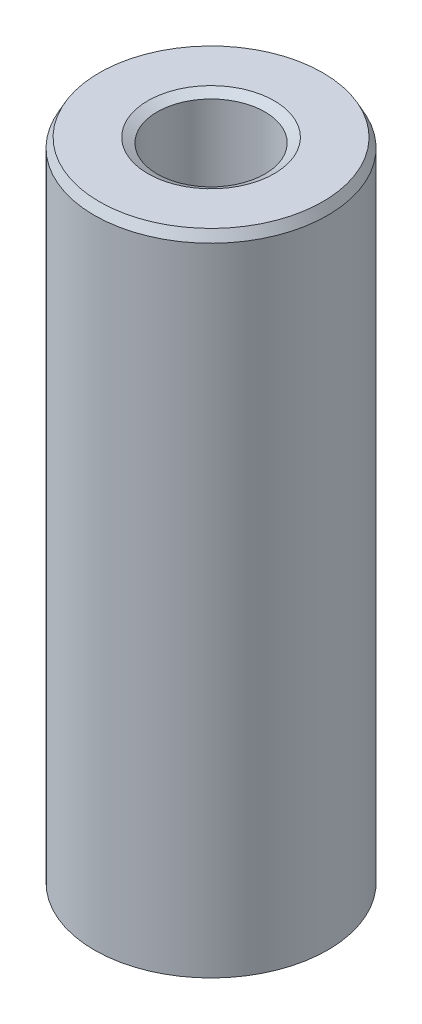
ISO-10303-21;
HEADER;
FILE_DESCRIPTION(('STEP AP214'),'2;1');
FILE_NAME('part.step','',(''),(''),'','','');
FILE_SCHEMA(('AUTOMOTIVE_DESIGN { 1 0 10303 214 1 1 1 1 }'));
ENDSEC;
DATA;
#1=APPLICATION_CONTEXT('core data for automotive mechanical design processes');
#2=APPLICATION_PROTOCOL_DEFINITION('international standard','automotive_design',2000,#1);
#3=PRODUCT_CONTEXT('',#1,'mechanical');
#4=PRODUCT('Part','Part','',(#3));
#5=PRODUCT_RELATED_PRODUCT_CATEGORY('part','',(#4));
#6=PRODUCT_DEFINITION_FORMATION('','',#4);
#7=PRODUCT_DEFINITION_CONTEXT('part definition',#1,'design');
#8=PRODUCT_DEFINITION('design','',#6,#7);
#9=PRODUCT_DEFINITION_SHAPE('','',#8);
#10=(LENGTH_UNIT() NAMED_UNIT(*) SI_UNIT(.MILLI.,.METRE.));
#11=(NAMED_UNIT(*) PLANE_ANGLE_UNIT() SI_UNIT($,.RADIAN.));
#12=(NAMED_UNIT(*) SI_UNIT($,.STERADIAN.) SOLID_ANGLE_UNIT());
#13=UNCERTAINTY_MEASURE_WITH_UNIT(LENGTH_MEASURE(1.E-05),#10,'distance_accuracy_value','');
#14=(GEOMETRIC_REPRESENTATION_CONTEXT(3) GLOBAL_UNCERTAINTY_ASSIGNED_CONTEXT((#13)) GLOBAL_UNIT_ASSIGNED_CONTEXT((#10,
#11,#12)) REPRESENTATION_CONTEXT('',''));
#15=CARTESIAN_POINT('',(0.,0.,0.));
#16=DIRECTION('',(0.,0.,1.));
#17=DIRECTION('',(1.,0.,0.));
#18=AXIS2_PLACEMENT_3D('',#15,#16,#17);
#19=CARTESIAN_POINT('',(0.,139.373056532674,0.));
#20=DIRECTION('',(0.,-1.,0.));
#21=DIRECTION('',(0.,0.,-1.));
#22=AXIS2_PLACEMENT_3D('',#19,#20,#21);
#23=CYLINDRICAL_SURFACE('',#22,25.);
#24=CARTESIAN_POINT('',(0.,1.06443118008448,0.));
#25=DIRECTION('',(0.,1.,0.));
#26=DIRECTION('',(0.,0.,1.));
#27=AXIS2_PLACEMENT_3D('',#24,#25,#26);
#28=CIRCLE('',#27,25.);
#29=CARTESIAN_POINT('',(0.,1.06443118008448,25.));
#30=VERTEX_POINT('',#29);
#31=EDGE_CURVE('E10',#30,#30,#28,.T.);
#32=ORIENTED_EDGE('',*,*,#31,.T.);
#33=EDGE_LOOP('',(#32));
#34=FACE_BOUND('',#33,.T.);
#35=CARTESIAN_POINT('',(0.,137.371228391076,0.));
#36=DIRECTION('',(0.,1.,0.));
#37=DIRECTION('',(0.,0.,1.));
#38=AXIS2_PLACEMENT_3D('',#35,#36,#37);
#39=CIRCLE('',#38,25.);
#40=CARTESIAN_POINT('',(0.,137.371228391076,25.));
#41=VERTEX_POINT('',#40);
#42=EDGE_CURVE('E50',#41,#41,#39,.F.);
#43=ORIENTED_EDGE('',*,*,#42,.T.);
#44=EDGE_LOOP('',(#43));
#45=FACE_BOUND('',#44,.T.);
#46=ADVANCED_FACE('F39',(#34,#45),#23,.T.);
#47=CARTESIAN_POINT('',(0.,139.373056532674,0.));
#48=DIRECTION('',(0.,1.,0.));
#49=DIRECTION('',(0.,0.,1.));
#50=AXIS2_PLACEMENT_3D('',#47,#48,#49);
#51=PLANE('',#50);
#52=CARTESIAN_POINT('',(0.,139.373056532674,0.));
#53=DIRECTION('',(0.,1.,0.));
#54=DIRECTION('',(0.,0.,1.));
#55=AXIS2_PLACEMENT_3D('',#52,#53,#54);
#56=CIRCLE('',#55,13.5419077164239);
#57=CARTESIAN_POINT('',(0.,139.373056532674,13.5419077164239));
#58=VERTEX_POINT('',#57);
#59=EDGE_CURVE('E58',#58,#58,#56,.F.);
#60=ORIENTED_EDGE('',*,*,#59,.T.);
#61=EDGE_LOOP('',(#60));
#62=FACE_BOUND('',#61,.T.);
#63=CARTESIAN_POINT('',(0.,139.373056532674,0.));
#64=DIRECTION('',(0.,1.,0.));
#65=DIRECTION('',(0.,0.,1.));
#66=AXIS2_PLACEMENT_3D('',#63,#64,#65);
#67=CIRCLE('',#66,23.9355688199155);
#68=CARTESIAN_POINT('',(0.,139.373056532674,23.9355688199155));
#69=VERTEX_POINT('',#68);
#70=EDGE_CURVE('E61',#69,#69,#67,.T.);
#71=ORIENTED_EDGE('',*,*,#70,.T.);
#72=EDGE_LOOP('',(#71));
#73=FACE_BOUND('',#72,.T.);
#74=ADVANCED_FACE('F88',(#62,#73),#51,.T.);
#75=CARTESIAN_POINT('',(0.,0.,0.));
#76=DIRECTION('',(0.,1.,0.));
#77=DIRECTION('',(0.,0.,1.));
#78=AXIS2_PLACEMENT_3D('',#75,#76,#77);
#79=PLANE('',#78);
#80=CARTESIAN_POINT('',(0.,0.,0.));
#81=DIRECTION('',(0.,1.,0.));
#82=DIRECTION('',(0.,0.,1.));
#83=AXIS2_PLACEMENT_3D('',#80,#81,#82);
#84=CIRCLE('',#83,12.6045107549096);
#85=CARTESIAN_POINT('',(0.,0.,12.6045107549096));
#86=VERTEX_POINT('',#85);
#87=EDGE_CURVE('E51',#86,#86,#84,.T.);
#88=ORIENTED_EDGE('',*,*,#87,.T.);
#89=EDGE_LOOP('',(#88));
#90=FACE_BOUND('',#89,.T.);
#91=CARTESIAN_POINT('',(0.,0.,0.));
#92=DIRECTION('',(0.,1.,0.));
#93=DIRECTION('',(0.,0.,1.));
#94=AXIS2_PLACEMENT_3D('',#91,#92,#93);
#95=CIRCLE('',#94,22.9981718584012);
#96=CARTESIAN_POINT('',(0.,0.,22.9981718584012));
#97=VERTEX_POINT('',#96);
#98=EDGE_CURVE('E54',#97,#97,#95,.F.);
#99=ORIENTED_EDGE('',*,*,#98,.T.);
#100=EDGE_LOOP('',(#99));
#101=FACE_BOUND('',#100,.T.);
#102=ADVANCED_FACE('F83',(#90,#101),#79,.F.);
#103=CARTESIAN_POINT('',(0.,139.373056532674,0.));
#104=DIRECTION('',(0.,-1.,0.));
#105=DIRECTION('',(0.,0.,-1.));
#106=AXIS2_PLACEMENT_3D('',#103,#104,#105);
#107=CYLINDRICAL_SURFACE('',#106,11.5400795748251);
#108=CARTESIAN_POINT('',(0.,138.30862535259,0.));
#109=DIRECTION('',(0.,1.,0.));
#110=DIRECTION('',(0.,0.,1.));
#111=AXIS2_PLACEMENT_3D('',#108,#109,#110);
#112=CIRCLE('',#111,11.5400795748251);
#113=CARTESIAN_POINT('',(0.,138.30862535259,11.5400795748251));
#114=VERTEX_POINT('',#113);
#115=EDGE_CURVE('E67',#114,#114,#112,.T.);
#116=ORIENTED_EDGE('',*,*,#115,.T.);
#117=EDGE_LOOP('',(#116));
#118=FACE_BOUND('',#117,.T.);
#119=CARTESIAN_POINT('',(0.,2.00182814159877,0.));
#120=DIRECTION('',(0.,1.,0.));
#121=DIRECTION('',(0.,0.,1.));
#122=AXIS2_PLACEMENT_3D('',#119,#120,#121);
#123=CIRCLE('',#122,11.5400795748251);
#124=CARTESIAN_POINT('',(0.,2.00182814159877,11.5400795748251));
#125=VERTEX_POINT('',#124);
#126=EDGE_CURVE('E69',#125,#125,#123,.F.);
#127=ORIENTED_EDGE('',*,*,#126,.T.);
#128=EDGE_LOOP('',(#127));
#129=FACE_BOUND('',#128,.T.);
#130=ADVANCED_FACE('F71',(#118,#129),#107,.F.);
#131=CARTESIAN_POINT('',(0.,138.30862535259,0.));
#132=DIRECTION('',(0.,1.,0.));
#133=DIRECTION('',(0.,0.,1.));
#134=AXIS2_PLACEMENT_3D('',#131,#132,#133);
#135=CONICAL_SURFACE('',#134,11.5400795748251,1.08208845094556);
#136=ORIENTED_EDGE('',*,*,#59,.F.);
#137=EDGE_LOOP('',(#136));
#138=FACE_BOUND('',#137,.T.);
#139=ORIENTED_EDGE('',*,*,#115,.F.);
#140=EDGE_LOOP('',(#139));
#141=FACE_BOUND('',#140,.T.);
#142=ADVANCED_FACE('F77',(#138,#141),#135,.F.);
#143=CARTESIAN_POINT('',(0.,0.,0.));
#144=DIRECTION('',(0.,-1.,0.));
#145=DIRECTION('',(0.,0.,-1.));
#146=AXIS2_PLACEMENT_3D('',#143,#144,#145);
#147=CONICAL_SURFACE('',#146,12.6045107549096,0.488707875849341);
#148=ORIENTED_EDGE('',*,*,#126,.F.);
#149=EDGE_LOOP('',(#148));
#150=FACE_BOUND('',#149,.T.);
#151=ORIENTED_EDGE('',*,*,#87,.F.);
#152=EDGE_LOOP('',(#151));
#153=FACE_BOUND('',#152,.T.);
#154=ADVANCED_FACE('F73',(#150,#153),#147,.F.);
#155=CARTESIAN_POINT('',(0.,1.06443118008448,0.));
#156=DIRECTION('',(0.,1.,0.));
#157=DIRECTION('',(0.,0.,1.));
#158=AXIS2_PLACEMENT_3D('',#155,#156,#157);
#159=CONICAL_SURFACE('',#158,25.,1.08208845094556);
#160=ORIENTED_EDGE('',*,*,#98,.F.);
#161=EDGE_LOOP('',(#160));
#162=FACE_BOUND('',#161,.T.);
#163=ORIENTED_EDGE('',*,*,#31,.F.);
#164=EDGE_LOOP('',(#163));
#165=FACE_BOUND('',#164,.T.);
#166=ADVANCED_FACE('F76',(#162,#165),#159,.T.);
#167=CARTESIAN_POINT('',(0.,139.373056532674,0.));
#168=DIRECTION('',(0.,-1.,0.));
#169=DIRECTION('',(0.,0.,-1.));
#170=AXIS2_PLACEMENT_3D('',#167,#168,#169);
#171=CONICAL_SURFACE('',#170,23.9355688199155,0.488707875849336);
#172=ORIENTED_EDGE('',*,*,#42,.F.);
#173=EDGE_LOOP('',(#172));
#174=FACE_BOUND('',#173,.T.);
#175=ORIENTED_EDGE('',*,*,#70,.F.);
#176=EDGE_LOOP('',(#175));
#177=FACE_BOUND('',#176,.T.);
#178=ADVANCED_FACE('F45',(#174,#177),#171,.T.);
#179=CLOSED_SHELL('',(#46,#74,#102,#130,#142,#154,#166,#178));
#180=MANIFOLD_SOLID_BREP('B2',#179);
#181=ADVANCED_BREP_SHAPE_REPRESENTATION('',(#18,#180),#14);
#182=SHAPE_DEFINITION_REPRESENTATION(#9,#181);
ENDSEC;
END-ISO-10303-21;
